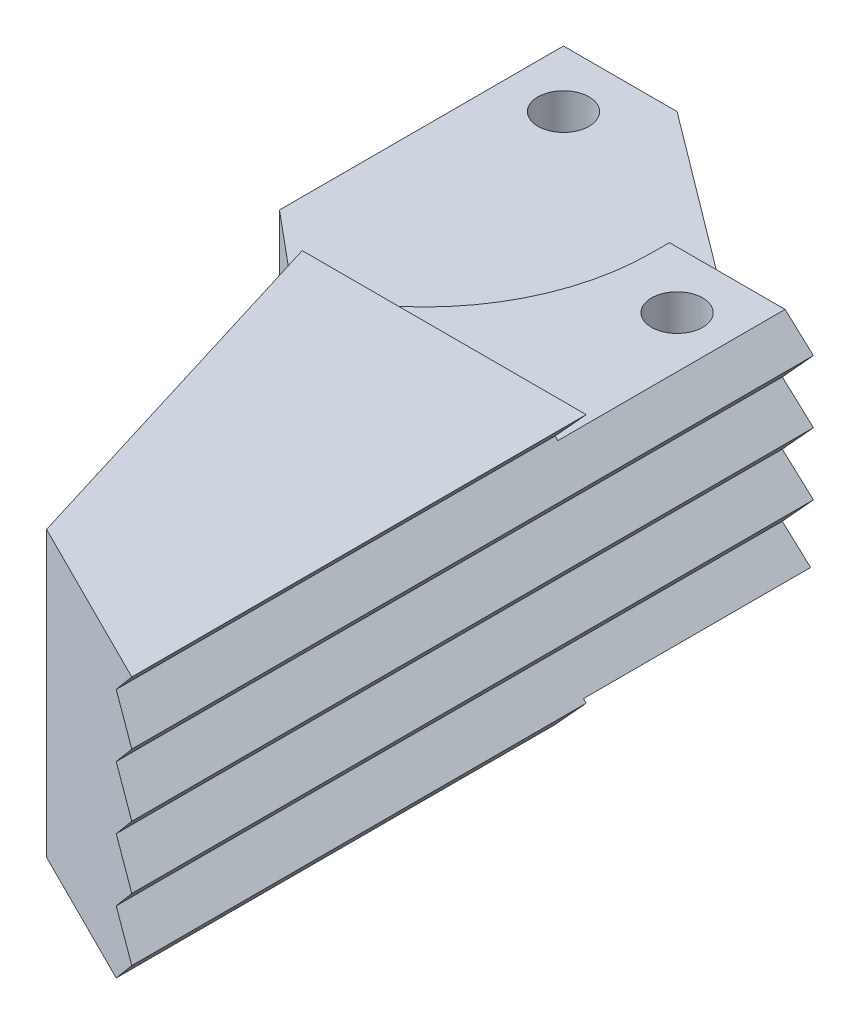
ISO-10303-21;
HEADER;
FILE_DESCRIPTION(('STEP AP214'),'2;1');
FILE_NAME('part.step','',(''),(''),'','','');
FILE_SCHEMA(('AUTOMOTIVE_DESIGN { 1 0 10303 214 1 1 1 1 }'));
ENDSEC;
DATA;
#1=APPLICATION_CONTEXT('core data for automotive mechanical design processes');
#2=APPLICATION_PROTOCOL_DEFINITION('international standard','automotive_design',2000,#1);
#3=PRODUCT_CONTEXT('',#1,'mechanical');
#4=PRODUCT('Part','Part','',(#3));
#5=PRODUCT_RELATED_PRODUCT_CATEGORY('part','',(#4));
#6=PRODUCT_DEFINITION_FORMATION('','',#4);
#7=PRODUCT_DEFINITION_CONTEXT('part definition',#1,'design');
#8=PRODUCT_DEFINITION('design','',#6,#7);
#9=PRODUCT_DEFINITION_SHAPE('','',#8);
#10=(LENGTH_UNIT() NAMED_UNIT(*) SI_UNIT(.MILLI.,.METRE.));
#11=(NAMED_UNIT(*) PLANE_ANGLE_UNIT() SI_UNIT($,.RADIAN.));
#12=(NAMED_UNIT(*) SI_UNIT($,.STERADIAN.) SOLID_ANGLE_UNIT());
#13=UNCERTAINTY_MEASURE_WITH_UNIT(LENGTH_MEASURE(1.E-05),#10,'distance_accuracy_value','');
#14=(GEOMETRIC_REPRESENTATION_CONTEXT(3) GLOBAL_UNCERTAINTY_ASSIGNED_CONTEXT((#13)) GLOBAL_UNIT_ASSIGNED_CONTEXT((#10,
#11,#12)) REPRESENTATION_CONTEXT('',''));
#15=CARTESIAN_POINT('',(0.,0.,0.));
#16=DIRECTION('',(0.,0.,1.));
#17=DIRECTION('',(1.,0.,0.));
#18=AXIS2_PLACEMENT_3D('',#15,#16,#17);
#19=CARTESIAN_POINT('',(37.,12.5,60.));
#20=DIRECTION('',(0.447213595499958,0.,-0.894427190999916));
#21=DIRECTION('',(-0.894427190999916,0.,-0.447213595499958));
#22=AXIS2_PLACEMENT_3D('',#19,#20,#21);
#23=PLANE('',#22);
#24=DIRECTION('',(-0.63887656499994,-0.699854212223765,-0.31943828249997));
#25=VECTOR('',#24,1.);
#26=CARTESIAN_POINT('',(46.8366500123377,1.27551020408162,64.9183250061688));
#27=LINE('',#26,#25);
#28=CARTESIAN_POINT('',(37.,-9.5,60.));
#29=VERTEX_POINT('',#28);
#30=CARTESIAN_POINT('',(34.2613872124742,-12.5,58.6306936062371));
#31=VERTEX_POINT('',#30);
#32=EDGE_CURVE('E217',#29,#31,#27,.T.);
#33=ORIENTED_EDGE('',*,*,#32,.F.);
#34=DIRECTION('',(0.692820323027551,-0.632455532033676,0.346410161513776));
#35=VECTOR('',#34,1.);
#36=CARTESIAN_POINT('',(27.3600829879091,-0.700000000000004,55.1800414939545));
#37=LINE('',#36,#35);
#38=CARTESIAN_POINT('',(34.2613872124742,-7.,58.6306936062371));
#39=VERTEX_POINT('',#38);
#40=EDGE_CURVE('E232',#39,#29,#37,.T.);
#41=ORIENTED_EDGE('',*,*,#40,.F.);
#42=DIRECTION('',(-0.63887656499994,-0.699854212223765,-0.31943828249997));
#43=VECTOR('',#42,1.);
#44=CARTESIAN_POINT('',(44.3774875092533,4.08163265306123,63.6887437546266));
#45=LINE('',#44,#43);
#46=CARTESIAN_POINT('',(37.,-4.,60.));
#47=VERTEX_POINT('',#46);
#48=EDGE_CURVE('E243',#47,#39,#45,.T.);
#49=ORIENTED_EDGE('',*,*,#48,.F.);
#50=DIRECTION('',(0.692820323027551,-0.632455532033675,0.346410161513776));
#51=VECTOR('',#50,1.);
#52=CARTESIAN_POINT('',(29.7700622409318,2.6,56.3850311204659));
#53=LINE('',#52,#51);
#54=CARTESIAN_POINT('',(34.2613872124742,-1.5,58.6306936062371));
#55=VERTEX_POINT('',#54);
#56=EDGE_CURVE('E528',#55,#47,#53,.T.);
#57=ORIENTED_EDGE('',*,*,#56,.F.);
#58=DIRECTION('',(-0.63887656499994,-0.699854212223765,-0.31943828249997));
#59=VECTOR('',#58,1.);
#60=CARTESIAN_POINT('',(41.9183250061688,6.88775510204082,62.4591625030844));
#61=LINE('',#60,#59);
#62=CARTESIAN_POINT('',(37.,1.5,60.));
#63=VERTEX_POINT('',#62);
#64=EDGE_CURVE('E531',#63,#55,#61,.T.);
#65=ORIENTED_EDGE('',*,*,#64,.F.);
#66=DIRECTION('',(0.692820323027551,-0.632455532033675,0.346410161513776));
#67=VECTOR('',#66,1.);
#68=CARTESIAN_POINT('',(32.1800414939545,5.9,57.5900207469773));
#69=LINE('',#68,#67);
#70=CARTESIAN_POINT('',(34.2613872124742,4.,58.6306936062371));
#71=VERTEX_POINT('',#70);
#72=EDGE_CURVE('E259',#71,#63,#69,.T.);
#73=ORIENTED_EDGE('',*,*,#72,.F.);
#74=DIRECTION('',(-0.638876564999939,-0.699854212223766,-0.31943828249997));
#75=VECTOR('',#74,1.);
#76=CARTESIAN_POINT('',(39.4591625030844,9.69387755102042,61.2295812515422));
#77=LINE('',#76,#75);
#78=CARTESIAN_POINT('',(37.,7.00000000000001,60.));
#79=VERTEX_POINT('',#78);
#80=EDGE_CURVE('E250',#79,#71,#77,.T.);
#81=ORIENTED_EDGE('',*,*,#80,.F.);
#82=DIRECTION('',(0.692820323027551,-0.632455532033676,0.346410161513776));
#83=VECTOR('',#82,1.);
#84=CARTESIAN_POINT('',(34.5900207469773,9.20000000000001,58.7950103734886));
#85=LINE('',#84,#83);
#86=CARTESIAN_POINT('',(34.2613872124742,9.50000000000001,58.6306936062371));
#87=VERTEX_POINT('',#86);
#88=EDGE_CURVE('E605',#87,#79,#85,.T.);
#89=ORIENTED_EDGE('',*,*,#88,.F.);
#90=DIRECTION('',(-0.638876564999941,-0.699854212223764,-0.319438282499971));
#91=VECTOR('',#90,1.);
#92=CARTESIAN_POINT('',(37.,12.5,60.));
#93=LINE('',#92,#91);
#94=CARTESIAN_POINT('',(37.,12.5,60.));
#95=VERTEX_POINT('',#94);
#96=EDGE_CURVE('E530',#95,#87,#93,.T.);
#97=ORIENTED_EDGE('',*,*,#96,.F.);
#98=DIRECTION('',(0.894427190999916,0.,0.447213595499958));
#99=VECTOR('',#98,1.);
#100=CARTESIAN_POINT('',(37.,12.5,60.));
#101=LINE('',#100,#99);
#102=CARTESIAN_POINT('',(22.,12.5,52.5));
#103=VERTEX_POINT('',#102);
#104=EDGE_CURVE('E368',#103,#95,#101,.T.);
#105=ORIENTED_EDGE('',*,*,#104,.F.);
#106=DIRECTION('',(0.,-1.,0.));
#107=VECTOR('',#106,1.);
#108=CARTESIAN_POINT('',(22.,12.5,52.5));
#109=LINE('',#108,#107);
#110=CARTESIAN_POINT('',(22.,-12.5,52.5));
#111=VERTEX_POINT('',#110);
#112=EDGE_CURVE('E376',#103,#111,#109,.T.);
#113=ORIENTED_EDGE('',*,*,#112,.T.);
#114=DIRECTION('',(0.894427190999916,0.,0.447213595499958));
#115=VECTOR('',#114,1.);
#116=CARTESIAN_POINT('',(37.,-12.5,60.));
#117=LINE('',#116,#115);
#118=EDGE_CURVE('E235',#111,#31,#117,.T.);
#119=ORIENTED_EDGE('',*,*,#118,.T.);
#120=EDGE_LOOP('',(#33,#41,#49,#57,#65,#73,#81,#89,#97,#105,#113,#119));
#121=FACE_BOUND('',#120,.T.);
#122=ADVANCED_FACE('F52',(#121),#23,.F.);
#123=CARTESIAN_POINT('',(37.,-4.6,20.));
#124=DIRECTION('',(0.,0.,1.));
#125=DIRECTION('',(1.,0.,0.));
#126=AXIS2_PLACEMENT_3D('',#123,#124,#125);
#127=PLANE('',#126);
#128=DIRECTION('',(0.,-1.,0.));
#129=VECTOR('',#128,1.);
#130=CARTESIAN_POINT('',(12.,12.5,20.));
#131=LINE('',#130,#129);
#132=CARTESIAN_POINT('',(12.,-9.275,20.));
#133=VERTEX_POINT('',#132);
#134=CARTESIAN_POINT('',(12.,-12.5,20.));
#135=VERTEX_POINT('',#134);
#136=EDGE_CURVE('E347',#133,#135,#131,.T.);
#137=ORIENTED_EDGE('',*,*,#136,.F.);
#138=DIRECTION('',(1.,0.,0.));
#139=VECTOR('',#138,1.);
#140=CARTESIAN_POINT('',(24.325,-9.275,20.));
#141=LINE('',#140,#139);
#142=CARTESIAN_POINT('',(36.7535248491227,-9.275,20.));
#143=VERTEX_POINT('',#142);
#144=EDGE_CURVE('E321',#133,#143,#141,.T.);
#145=ORIENTED_EDGE('',*,*,#144,.T.);
#146=DIRECTION('',(-0.738548945875997,0.674199862463242,0.));
#147=VECTOR('',#146,1.);
#148=CARTESIAN_POINT('',(34.5601449711134,-7.27272727272727,20.));
#149=LINE('',#148,#147);
#150=CARTESIAN_POINT('',(37.,-9.5,20.));
#151=VERTEX_POINT('',#150);
#152=EDGE_CURVE('E244',#151,#143,#149,.T.);
#153=ORIENTED_EDGE('',*,*,#152,.F.);
#154=DIRECTION('',(0.674199862463242,0.738548945875996,0.));
#155=VECTOR('',#154,1.);
#156=CARTESIAN_POINT('',(39.4398550288867,-6.82727272727273,20.));
#157=LINE('',#156,#155);
#158=CARTESIAN_POINT('',(34.2613872124742,-12.5,20.));
#159=VERTEX_POINT('',#158);
#160=EDGE_CURVE('E220',#159,#151,#157,.T.);
#161=ORIENTED_EDGE('',*,*,#160,.F.);
#162=DIRECTION('',(-1.,0.,0.));
#163=VECTOR('',#162,1.);
#164=CARTESIAN_POINT('',(37.,-12.5,20.));
#165=LINE('',#164,#163);
#166=EDGE_CURVE('E343',#159,#135,#165,.T.);
#167=ORIENTED_EDGE('',*,*,#166,.T.);
#168=EDGE_LOOP('',(#137,#145,#153,#161,#167));
#169=FACE_BOUND('',#168,.T.);
#170=ADVANCED_FACE('F632',(#169),#127,.F.);
#171=CARTESIAN_POINT('',(0.,-12.5,0.));
#172=DIRECTION('',(0.,-1.,0.));
#173=DIRECTION('',(0.,0.,-1.));
#174=AXIS2_PLACEMENT_3D('',#171,#172,#173);
#175=PLANE('',#174);
#176=ORIENTED_EDGE('',*,*,#166,.F.);
#177=DIRECTION('',(0.,0.,-1.));
#178=VECTOR('',#177,1.);
#179=CARTESIAN_POINT('',(34.2613872124742,-12.5,60.));
#180=LINE('',#179,#178);
#181=EDGE_CURVE('E521',#31,#159,#180,.T.);
#182=ORIENTED_EDGE('',*,*,#181,.F.);
#183=ORIENTED_EDGE('',*,*,#118,.F.);
#184=DIRECTION('',(0.294085848837523,0.,0.95577900872195));
#185=VECTOR('',#184,1.);
#186=CARTESIAN_POINT('',(22.,-12.5,52.5));
#187=LINE('',#186,#185);
#188=EDGE_CURVE('E364',#135,#111,#187,.T.);
#189=ORIENTED_EDGE('',*,*,#188,.F.);
#190=EDGE_LOOP('',(#176,#182,#183,#189));
#191=FACE_BOUND('',#190,.T.);
#192=ADVANCED_FACE('F636',(#191),#175,.T.);
#193=CARTESIAN_POINT('',(0.,12.5,0.));
#194=DIRECTION('',(0.,0.,1.));
#195=DIRECTION('',(1.,0.,0.));
#196=AXIS2_PLACEMENT_3D('',#193,#194,#195);
#197=PLANE('',#196);
#198=DIRECTION('',(0.738548945875997,-0.674199862463242,0.));
#199=VECTOR('',#198,1.);
#200=CARTESIAN_POINT('',(14.8264634272539,16.2415769342647,0.));
#201=LINE('',#200,#199);
#202=CARTESIAN_POINT('',(34.2613872124742,-1.5,0.));
#203=VERTEX_POINT('',#202);
#204=CARTESIAN_POINT('',(37.,-4.,0.));
#205=VERTEX_POINT('',#204);
#206=EDGE_CURVE('E538',#203,#205,#201,.T.);
#207=ORIENTED_EDGE('',*,*,#206,.T.);
#208=DIRECTION('',(-0.674199862463242,-0.738548945875997,0.));
#209=VECTOR('',#208,1.);
#210=CARTESIAN_POINT('',(22.1735365727461,-20.2415769342647,0.));
#211=LINE('',#210,#209);
#212=CARTESIAN_POINT('',(34.2613872124742,-7.,0.));
#213=VERTEX_POINT('',#212);
#214=EDGE_CURVE('E553',#205,#213,#211,.T.);
#215=ORIENTED_EDGE('',*,*,#214,.T.);
#216=DIRECTION('',(0.738548945875997,-0.674199862463242,0.));
#217=VECTOR('',#216,1.);
#218=CARTESIAN_POINT('',(12.0878506397281,13.2415769342647,0.));
#219=LINE('',#218,#217);
#220=CARTESIAN_POINT('',(36.7535248491227,-9.275,0.));
#221=VERTEX_POINT('',#220);
#222=EDGE_CURVE('E560',#213,#221,#219,.T.);
#223=ORIENTED_EDGE('',*,*,#222,.T.);
#224=DIRECTION('',(1.,0.,0.));
#225=VECTOR('',#224,1.);
#226=CARTESIAN_POINT('',(24.325,-9.275,0.));
#227=LINE('',#226,#225);
#228=CARTESIAN_POINT('',(24.325,-9.275,0.));
#229=VERTEX_POINT('',#228);
#230=EDGE_CURVE('E331',#229,#221,#227,.T.);
#231=ORIENTED_EDGE('',*,*,#230,.F.);
#232=DIRECTION('',(0.,1.,0.));
#233=VECTOR('',#232,1.);
#234=CARTESIAN_POINT('',(24.325,-9.275,0.));
#235=LINE('',#234,#233);
#236=CARTESIAN_POINT('',(24.325,-4.6,0.));
#237=VERTEX_POINT('',#236);
#238=EDGE_CURVE('E314',#229,#237,#235,.T.);
#239=ORIENTED_EDGE('',*,*,#238,.T.);
#240=DIRECTION('',(1.,0.,0.));
#241=VECTOR('',#240,1.);
#242=CARTESIAN_POINT('',(0.,-4.6,0.));
#243=LINE('',#242,#241);
#244=CARTESIAN_POINT('',(30.,-4.6,0.));
#245=VERTEX_POINT('',#244);
#246=EDGE_CURVE('E288',#237,#245,#243,.T.);
#247=ORIENTED_EDGE('',*,*,#246,.T.);
#248=DIRECTION('',(0.,1.,0.));
#249=VECTOR('',#248,1.);
#250=CARTESIAN_POINT('',(30.,-38.1410196624968,0.));
#251=LINE('',#250,#249);
#252=CARTESIAN_POINT('',(30.,4.6,0.));
#253=VERTEX_POINT('',#252);
#254=EDGE_CURVE('E305',#245,#253,#251,.T.);
#255=ORIENTED_EDGE('',*,*,#254,.T.);
#256=DIRECTION('',(1.,0.,0.));
#257=VECTOR('',#256,1.);
#258=CARTESIAN_POINT('',(0.,4.6,0.));
#259=LINE('',#258,#257);
#260=CARTESIAN_POINT('',(24.325,4.6,0.));
#261=VERTEX_POINT('',#260);
#262=EDGE_CURVE('E284',#261,#253,#259,.T.);
#263=ORIENTED_EDGE('',*,*,#262,.F.);
#264=CARTESIAN_POINT('',(24.325,9.275,0.));
#265=VERTEX_POINT('',#264);
#266=EDGE_CURVE('E313',#261,#265,#235,.T.);
#267=ORIENTED_EDGE('',*,*,#266,.T.);
#268=DIRECTION('',(1.,0.,0.));
#269=VECTOR('',#268,1.);
#270=CARTESIAN_POINT('',(24.325,9.275,0.));
#271=LINE('',#270,#269);
#272=CARTESIAN_POINT('',(34.5078623633515,9.275,0.));
#273=VERTEX_POINT('',#272);
#274=EDGE_CURVE('E327',#265,#273,#271,.T.);
#275=ORIENTED_EDGE('',*,*,#274,.T.);
#276=DIRECTION('',(0.738548945875996,-0.674199862463242,0.));
#277=VECTOR('',#276,1.);
#278=CARTESIAN_POINT('',(20.3036890023056,22.2415769342647,0.));
#279=LINE('',#278,#277);
#280=CARTESIAN_POINT('',(37.,7.00000000000001,0.));
#281=VERTEX_POINT('',#280);
#282=EDGE_CURVE('E237',#273,#281,#279,.T.);
#283=ORIENTED_EDGE('',*,*,#282,.T.);
#284=DIRECTION('',(-0.674199862463241,-0.738548945875997,0.));
#285=VECTOR('',#284,1.);
#286=CARTESIAN_POINT('',(16.6963109976945,-15.2415769342647,0.));
#287=LINE('',#286,#285);
#288=CARTESIAN_POINT('',(34.2613872124742,4.,0.));
#289=VERTEX_POINT('',#288);
#290=EDGE_CURVE('E574',#281,#289,#287,.T.);
#291=ORIENTED_EDGE('',*,*,#290,.T.);
#292=DIRECTION('',(0.738548945875997,-0.674199862463242,0.));
#293=VECTOR('',#292,1.);
#294=CARTESIAN_POINT('',(17.5650762147798,19.2415769342647,0.));
#295=LINE('',#294,#293);
#296=CARTESIAN_POINT('',(37.,1.5,0.));
#297=VERTEX_POINT('',#296);
#298=EDGE_CURVE('E225',#289,#297,#295,.T.);
#299=ORIENTED_EDGE('',*,*,#298,.T.);
#300=DIRECTION('',(-0.674199862463242,-0.738548945875997,0.));
#301=VECTOR('',#300,1.);
#302=CARTESIAN_POINT('',(19.4349237852202,-17.7415769342647,0.));
#303=LINE('',#302,#301);
#304=EDGE_CURVE('E550',#297,#203,#303,.T.);
#305=ORIENTED_EDGE('',*,*,#304,.T.);
#306=EDGE_LOOP('',(#207,#215,#223,#231,#239,#247,#255,#263,#267,#275,#283,#291,#299,#305));
#307=FACE_BOUND('',#306,.T.);
#308=ADVANCED_FACE('F593',(#307),#197,.F.);
#309=CARTESIAN_POINT('',(37.,4.6,20.));
#310=DIRECTION('',(0.,0.,1.));
#311=DIRECTION('',(1.,0.,0.));
#312=AXIS2_PLACEMENT_3D('',#309,#310,#311);
#313=PLANE('',#312);
#314=DIRECTION('',(1.,0.,0.));
#315=VECTOR('',#314,1.);
#316=CARTESIAN_POINT('',(24.325,9.275,20.));
#317=LINE('',#316,#315);
#318=CARTESIAN_POINT('',(12.,9.275,20.));
#319=VERTEX_POINT('',#318);
#320=CARTESIAN_POINT('',(34.5078623633515,9.275,20.));
#321=VERTEX_POINT('',#320);
#322=EDGE_CURVE('E322',#319,#321,#317,.T.);
#323=ORIENTED_EDGE('',*,*,#322,.F.);
#324=DIRECTION('',(0.,-1.,0.));
#325=VECTOR('',#324,1.);
#326=CARTESIAN_POINT('',(12.,12.5,20.));
#327=LINE('',#326,#325);
#328=CARTESIAN_POINT('',(12.,12.5,20.));
#329=VERTEX_POINT('',#328);
#330=EDGE_CURVE('E384',#329,#319,#327,.T.);
#331=ORIENTED_EDGE('',*,*,#330,.F.);
#332=DIRECTION('',(-1.,0.,0.));
#333=VECTOR('',#332,1.);
#334=CARTESIAN_POINT('',(0.,12.5,20.));
#335=LINE('',#334,#333);
#336=CARTESIAN_POINT('',(37.,12.5,20.));
#337=VERTEX_POINT('',#336);
#338=EDGE_CURVE('E289',#337,#329,#335,.T.);
#339=ORIENTED_EDGE('',*,*,#338,.F.);
#340=DIRECTION('',(0.674199862463243,0.738548945875996,0.));
#341=VECTOR('',#340,1.);
#342=CARTESIAN_POINT('',(33.0663561779174,8.1909090909091,20.));
#343=LINE('',#342,#341);
#344=CARTESIAN_POINT('',(34.2613872124742,9.50000000000001,20.));
#345=VERTEX_POINT('',#344);
#346=EDGE_CURVE('E402',#345,#337,#343,.T.);
#347=ORIENTED_EDGE('',*,*,#346,.F.);
#348=DIRECTION('',(-0.738548945875996,0.674199862463242,0.));
#349=VECTOR('',#348,1.);
#350=CARTESIAN_POINT('',(38.1950310345567,5.90909090909091,20.));
#351=LINE('',#350,#349);
#352=EDGE_CURVE('E602',#321,#345,#351,.T.);
#353=ORIENTED_EDGE('',*,*,#352,.F.);
#354=EDGE_LOOP('',(#323,#331,#339,#347,#353));
#355=FACE_BOUND('',#354,.T.);
#356=ADVANCED_FACE('F676',(#355),#313,.F.);
#357=CARTESIAN_POINT('',(24.325,9.275,20.));
#358=DIRECTION('',(0.,1.,0.));
#359=DIRECTION('',(0.,0.,1.));
#360=AXIS2_PLACEMENT_3D('',#357,#358,#359);
#361=PLANE('',#360);
#362=CARTESIAN_POINT('',(30.,9.275,5.));
#363=DIRECTION('',(0.,1.,0.));
#364=DIRECTION('',(0.,0.,1.));
#365=AXIS2_PLACEMENT_3D('',#362,#363,#364);
#366=CIRCLE('',#365,2.24999999999999);
#367=CARTESIAN_POINT('',(30.,9.275,7.24999999999999));
#368=VERTEX_POINT('',#367);
#369=EDGE_CURVE('E263',#368,#368,#366,.T.);
#370=ORIENTED_EDGE('',*,*,#369,.F.);
#371=EDGE_LOOP('',(#370));
#372=FACE_BOUND('',#371,.T.);
#373=ORIENTED_EDGE('',*,*,#322,.T.);
#374=DIRECTION('',(0.,0.,-1.));
#375=VECTOR('',#374,1.);
#376=CARTESIAN_POINT('',(34.5078623633515,9.275,20.));
#377=LINE('',#376,#375);
#378=EDGE_CURVE('E455',#321,#273,#377,.T.);
#379=ORIENTED_EDGE('',*,*,#378,.T.);
#380=ORIENTED_EDGE('',*,*,#274,.F.);
#381=DIRECTION('',(0.,0.,1.));
#382=VECTOR('',#381,1.);
#383=CARTESIAN_POINT('',(24.325,9.275,20.));
#384=LINE('',#383,#382);
#385=CARTESIAN_POINT('',(24.325,9.275,1.53125951776895));
#386=VERTEX_POINT('',#385);
#387=EDGE_CURVE('E318',#265,#386,#384,.T.);
#388=ORIENTED_EDGE('',*,*,#387,.T.);
#389=CARTESIAN_POINT('',(4.32500000000001,9.275,1.53125951776895));
#390=DIRECTION('',(0.,1.,0.));
#391=DIRECTION('',(0.,0.,1.));
#392=AXIS2_PLACEMENT_3D('',#389,#390,#391);
#393=CIRCLE('',#392,20.);
#394=EDGE_CURVE('E12',#386,#319,#393,.F.);
#395=ORIENTED_EDGE('',*,*,#394,.T.);
#396=EDGE_LOOP('',(#373,#379,#380,#388,#395));
#397=FACE_BOUND('',#396,.T.);
#398=ADVANCED_FACE('F600',(#372,#397),#361,.T.);
#399=CARTESIAN_POINT('',(24.325,-9.275,20.));
#400=DIRECTION('',(0.,-1.,0.));
#401=DIRECTION('',(0.,0.,-1.));
#402=AXIS2_PLACEMENT_3D('',#399,#400,#401);
#403=PLANE('',#402);
#404=CARTESIAN_POINT('',(30.,-9.275,5.));
#405=DIRECTION('',(0.,-1.,0.));
#406=DIRECTION('',(0.,0.,-1.));
#407=AXIS2_PLACEMENT_3D('',#404,#405,#406);
#408=CIRCLE('',#407,2.24999999999999);
#409=CARTESIAN_POINT('',(30.,-9.275,2.75000000000001));
#410=VERTEX_POINT('',#409);
#411=EDGE_CURVE('E267',#410,#410,#408,.T.);
#412=ORIENTED_EDGE('',*,*,#411,.F.);
#413=EDGE_LOOP('',(#412));
#414=FACE_BOUND('',#413,.T.);
#415=ORIENTED_EDGE('',*,*,#230,.T.);
#416=DIRECTION('',(0.,0.,1.));
#417=VECTOR('',#416,1.);
#418=CARTESIAN_POINT('',(36.7535248491227,-9.275,20.));
#419=LINE('',#418,#417);
#420=EDGE_CURVE('E296',#221,#143,#419,.T.);
#421=ORIENTED_EDGE('',*,*,#420,.T.);
#422=ORIENTED_EDGE('',*,*,#144,.F.);
#423=CARTESIAN_POINT('',(4.32500000000001,-9.275,1.53125951776895));
#424=DIRECTION('',(0.,-1.,0.));
#425=DIRECTION('',(0.,0.,-1.));
#426=AXIS2_PLACEMENT_3D('',#423,#424,#425);
#427=CIRCLE('',#426,20.);
#428=CARTESIAN_POINT('',(24.325,-9.275,1.53125951776895));
#429=VERTEX_POINT('',#428);
#430=EDGE_CURVE('E61',#133,#429,#427,.F.);
#431=ORIENTED_EDGE('',*,*,#430,.T.);
#432=DIRECTION('',(0.,0.,-1.));
#433=VECTOR('',#432,1.);
#434=CARTESIAN_POINT('',(24.325,-9.275,20.));
#435=LINE('',#434,#433);
#436=EDGE_CURVE('E310',#429,#229,#435,.T.);
#437=ORIENTED_EDGE('',*,*,#436,.T.);
#438=EDGE_LOOP('',(#415,#421,#422,#431,#437));
#439=FACE_BOUND('',#438,.T.);
#440=ADVANCED_FACE('F420',(#414,#439),#403,.T.);
#441=CARTESIAN_POINT('',(0.,12.5,10.));
#442=DIRECTION('',(1.,0.,0.));
#443=DIRECTION('',(0.,0.,-1.));
#444=AXIS2_PLACEMENT_3D('',#441,#442,#443);
#445=PLANE('',#444);
#446=DIRECTION('',(0.,0.,-1.));
#447=VECTOR('',#446,1.);
#448=CARTESIAN_POINT('',(0.,-4.6,0.));
#449=LINE('',#448,#447);
#450=CARTESIAN_POINT('',(0.,-4.6,9.99999999999999));
#451=VERTEX_POINT('',#450);
#452=CARTESIAN_POINT('',(0.,-4.6,-15.));
#453=VERTEX_POINT('',#452);
#454=EDGE_CURVE('E344',#451,#453,#449,.T.);
#455=ORIENTED_EDGE('',*,*,#454,.F.);
#456=DIRECTION('',(0.,-1.,0.));
#457=VECTOR('',#456,1.);
#458=CARTESIAN_POINT('',(0.,12.5,10.));
#459=LINE('',#458,#457);
#460=CARTESIAN_POINT('',(0.,4.6,9.99999999999999));
#461=VERTEX_POINT('',#460);
#462=EDGE_CURVE('E388',#461,#451,#459,.T.);
#463=ORIENTED_EDGE('',*,*,#462,.F.);
#464=DIRECTION('',(0.,0.,1.));
#465=VECTOR('',#464,1.);
#466=CARTESIAN_POINT('',(0.,4.6,0.));
#467=LINE('',#466,#465);
#468=CARTESIAN_POINT('',(0.,4.6,-15.));
#469=VERTEX_POINT('',#468);
#470=EDGE_CURVE('E357',#469,#461,#467,.T.);
#471=ORIENTED_EDGE('',*,*,#470,.F.);
#472=DIRECTION('',(0.,1.,0.));
#473=VECTOR('',#472,1.);
#474=CARTESIAN_POINT('',(0.,-38.1410196624968,-15.));
#475=LINE('',#474,#473);
#476=EDGE_CURVE('E301',#453,#469,#475,.T.);
#477=ORIENTED_EDGE('',*,*,#476,.F.);
#478=EDGE_LOOP('',(#455,#463,#471,#477));
#479=FACE_BOUND('',#478,.T.);
#480=ADVANCED_FACE('F647',(#479),#445,.F.);
#481=CARTESIAN_POINT('',(12.,12.5,20.));
#482=DIRECTION('',(0.64018439966448,0.,-0.768221279597376));
#483=DIRECTION('',(-0.768221279597376,0.,-0.64018439966448));
#484=AXIS2_PLACEMENT_3D('',#481,#482,#483);
#485=PLANE('',#484);
#486=DIRECTION('',(-0.768221279597376,0.,-0.64018439966448));
#487=VECTOR('',#486,1.);
#488=CARTESIAN_POINT('',(12.,-4.6,20.));
#489=LINE('',#488,#487);
#490=CARTESIAN_POINT('',(12.,-4.6,20.));
#491=VERTEX_POINT('',#490);
#492=EDGE_CURVE('E354',#491,#451,#489,.T.);
#493=ORIENTED_EDGE('',*,*,#492,.F.);
#494=CARTESIAN_POINT('',(12.,4.6,20.));
#495=VERTEX_POINT('',#494);
#496=EDGE_CURVE('E383',#495,#491,#327,.T.);
#497=ORIENTED_EDGE('',*,*,#496,.F.);
#498=DIRECTION('',(-0.768221279597376,0.,-0.64018439966448));
#499=VECTOR('',#498,1.);
#500=CARTESIAN_POINT('',(12.,4.6,20.));
#501=LINE('',#500,#499);
#502=EDGE_CURVE('E360',#495,#461,#501,.T.);
#503=ORIENTED_EDGE('',*,*,#502,.T.);
#504=ORIENTED_EDGE('',*,*,#462,.T.);
#505=EDGE_LOOP('',(#493,#497,#503,#504));
#506=FACE_BOUND('',#505,.T.);
#507=ADVANCED_FACE('F440',(#506),#485,.F.);
#508=CARTESIAN_POINT('',(22.,12.5,52.5));
#509=DIRECTION('',(0.95577900872195,0.,-0.294085848837523));
#510=DIRECTION('',(-0.294085848837523,0.,-0.95577900872195));
#511=AXIS2_PLACEMENT_3D('',#508,#509,#510);
#512=PLANE('',#511);
#513=ORIENTED_EDGE('',*,*,#188,.T.);
#514=ORIENTED_EDGE('',*,*,#112,.F.);
#515=DIRECTION('',(0.294085848837523,0.,0.95577900872195));
#516=VECTOR('',#515,1.);
#517=CARTESIAN_POINT('',(22.,12.5,52.5));
#518=LINE('',#517,#516);
#519=EDGE_CURVE('E365',#329,#103,#518,.T.);
#520=ORIENTED_EDGE('',*,*,#519,.F.);
#521=ORIENTED_EDGE('',*,*,#330,.T.);
#522=EDGE_CURVE('E389',#319,#495,#327,.T.);
#523=ORIENTED_EDGE('',*,*,#522,.T.);
#524=ORIENTED_EDGE('',*,*,#496,.T.);
#525=EDGE_CURVE('E350',#491,#133,#131,.T.);
#526=ORIENTED_EDGE('',*,*,#525,.T.);
#527=ORIENTED_EDGE('',*,*,#136,.T.);
#528=EDGE_LOOP('',(#513,#514,#520,#521,#523,#524,#526,#527));
#529=FACE_BOUND('',#528,.T.);
#530=ADVANCED_FACE('F444',(#529),#512,.F.);
#531=CARTESIAN_POINT('',(0.,12.5,0.));
#532=DIRECTION('',(0.,-1.,0.));
#533=DIRECTION('',(0.,0.,-1.));
#534=AXIS2_PLACEMENT_3D('',#531,#532,#533);
#535=PLANE('',#534);
#536=DIRECTION('',(0.,0.,-1.));
#537=VECTOR('',#536,1.);
#538=CARTESIAN_POINT('',(37.,12.5,0.));
#539=LINE('',#538,#537);
#540=EDGE_CURVE('E372',#95,#337,#539,.T.);
#541=ORIENTED_EDGE('',*,*,#540,.T.);
#542=ORIENTED_EDGE('',*,*,#338,.T.);
#543=ORIENTED_EDGE('',*,*,#519,.T.);
#544=ORIENTED_EDGE('',*,*,#104,.T.);
#545=EDGE_LOOP('',(#541,#542,#543,#544));
#546=FACE_BOUND('',#545,.T.);
#547=ADVANCED_FACE('F644',(#546),#535,.F.);
#548=CARTESIAN_POINT('',(0.,4.6,0.));
#549=DIRECTION('',(0.,-1.,0.));
#550=DIRECTION('',(0.,0.,-1.));
#551=AXIS2_PLACEMENT_3D('',#548,#549,#550);
#552=PLANE('',#551);
#553=CARTESIAN_POINT('',(5.,4.6,-10.));
#554=DIRECTION('',(0.,-1.,0.));
#555=DIRECTION('',(0.,0.,-1.));
#556=AXIS2_PLACEMENT_3D('',#553,#554,#555);
#557=CIRCLE('',#556,2.24999999999999);
#558=CARTESIAN_POINT('',(5.,4.6,-12.25));
#559=VERTEX_POINT('',#558);
#560=EDGE_CURVE('E271',#559,#559,#557,.T.);
#561=ORIENTED_EDGE('',*,*,#560,.T.);
#562=EDGE_LOOP('',(#561));
#563=FACE_BOUND('',#562,.T.);
#564=ORIENTED_EDGE('',*,*,#502,.F.);
#565=CARTESIAN_POINT('',(4.32500000000001,4.6,1.53125951776895));
#566=DIRECTION('',(0.,-1.,0.));
#567=DIRECTION('',(0.,0.,-1.));
#568=AXIS2_PLACEMENT_3D('',#565,#566,#567);
#569=CIRCLE('',#568,20.);
#570=CARTESIAN_POINT('',(24.325,4.6,1.53125951776895));
#571=VERTEX_POINT('',#570);
#572=EDGE_CURVE('E76',#495,#571,#569,.F.);
#573=ORIENTED_EDGE('',*,*,#572,.T.);
#574=DIRECTION('',(0.,0.,-1.));
#575=VECTOR('',#574,1.);
#576=CARTESIAN_POINT('',(24.325,4.6,0.));
#577=LINE('',#576,#575);
#578=EDGE_CURVE('E340',#571,#261,#577,.T.);
#579=ORIENTED_EDGE('',*,*,#578,.T.);
#580=ORIENTED_EDGE('',*,*,#262,.T.);
#581=DIRECTION('',(-0.8,0.,-0.6));
#582=VECTOR('',#581,1.);
#583=CARTESIAN_POINT('',(30.,4.6,0.));
#584=LINE('',#583,#582);
#585=CARTESIAN_POINT('',(10.,4.6,-15.));
#586=VERTEX_POINT('',#585);
#587=EDGE_CURVE('E275',#253,#586,#584,.T.);
#588=ORIENTED_EDGE('',*,*,#587,.T.);
#589=DIRECTION('',(-1.,0.,0.));
#590=VECTOR('',#589,1.);
#591=CARTESIAN_POINT('',(10.,4.6,-15.));
#592=LINE('',#591,#590);
#593=EDGE_CURVE('E276',#586,#469,#592,.T.);
#594=ORIENTED_EDGE('',*,*,#593,.T.);
#595=ORIENTED_EDGE('',*,*,#470,.T.);
#596=EDGE_LOOP('',(#564,#573,#579,#580,#588,#594,#595));
#597=FACE_BOUND('',#596,.T.);
#598=ADVANCED_FACE('F664',(#563,#597),#552,.F.);
#599=CARTESIAN_POINT('',(0.,-4.6,0.));
#600=DIRECTION('',(0.,-1.,0.));
#601=DIRECTION('',(0.,0.,-1.));
#602=AXIS2_PLACEMENT_3D('',#599,#600,#601);
#603=PLANE('',#602);
#604=CARTESIAN_POINT('',(5.,-4.6,-10.));
#605=DIRECTION('',(0.,-1.,0.));
#606=DIRECTION('',(0.,0.,-1.));
#607=AXIS2_PLACEMENT_3D('',#604,#605,#606);
#608=CIRCLE('',#607,2.24999999999999);
#609=CARTESIAN_POINT('',(5.,-4.6,-12.25));
#610=VERTEX_POINT('',#609);
#611=EDGE_CURVE('E270',#610,#610,#608,.T.);
#612=ORIENTED_EDGE('',*,*,#611,.F.);
#613=EDGE_LOOP('',(#612));
#614=FACE_BOUND('',#613,.T.);
#615=DIRECTION('',(0.,0.,-1.));
#616=VECTOR('',#615,1.);
#617=CARTESIAN_POINT('',(24.325,-4.6,0.));
#618=LINE('',#617,#616);
#619=CARTESIAN_POINT('',(24.325,-4.6,1.53125951776895));
#620=VERTEX_POINT('',#619);
#621=EDGE_CURVE('E326',#620,#237,#618,.T.);
#622=ORIENTED_EDGE('',*,*,#621,.F.);
#623=CARTESIAN_POINT('',(4.32500000000001,-4.6,1.53125951776895));
#624=DIRECTION('',(0.,-1.,0.));
#625=DIRECTION('',(0.,0.,-1.));
#626=AXIS2_PLACEMENT_3D('',#623,#624,#625);
#627=CIRCLE('',#626,20.);
#628=EDGE_CURVE('E408',#620,#491,#627,.T.);
#629=ORIENTED_EDGE('',*,*,#628,.T.);
#630=ORIENTED_EDGE('',*,*,#492,.T.);
#631=ORIENTED_EDGE('',*,*,#454,.T.);
#632=DIRECTION('',(-1.,0.,0.));
#633=VECTOR('',#632,1.);
#634=CARTESIAN_POINT('',(10.,-4.6,-15.));
#635=LINE('',#634,#633);
#636=CARTESIAN_POINT('',(10.,-4.6,-15.));
#637=VERTEX_POINT('',#636);
#638=EDGE_CURVE('E297',#637,#453,#635,.T.);
#639=ORIENTED_EDGE('',*,*,#638,.F.);
#640=DIRECTION('',(-0.8,0.,-0.6));
#641=VECTOR('',#640,1.);
#642=CARTESIAN_POINT('',(30.,-4.6,0.));
#643=LINE('',#642,#641);
#644=EDGE_CURVE('E280',#245,#637,#643,.T.);
#645=ORIENTED_EDGE('',*,*,#644,.F.);
#646=ORIENTED_EDGE('',*,*,#246,.F.);
#647=EDGE_LOOP('',(#622,#629,#630,#631,#639,#645,#646));
#648=FACE_BOUND('',#647,.T.);
#649=ADVANCED_FACE('F434',(#614,#648),#603,.T.);
#650=CARTESIAN_POINT('',(24.325,0.,0.));
#651=DIRECTION('',(-1.,0.,0.));
#652=DIRECTION('',(0.,0.,1.));
#653=AXIS2_PLACEMENT_3D('',#650,#651,#652);
#654=PLANE('',#653);
#655=ORIENTED_EDGE('',*,*,#436,.F.);
#656=DIRECTION('',(0.,-1.,0.));
#657=VECTOR('',#656,1.);
#658=CARTESIAN_POINT('',(24.325,-4.6,1.53125951776895));
#659=LINE('',#658,#657);
#660=EDGE_CURVE('E405',#429,#620,#659,.F.);
#661=ORIENTED_EDGE('',*,*,#660,.T.);
#662=ORIENTED_EDGE('',*,*,#621,.T.);
#663=ORIENTED_EDGE('',*,*,#238,.F.);
#664=EDGE_LOOP('',(#655,#661,#662,#663));
#665=FACE_BOUND('',#664,.T.);
#666=ADVANCED_FACE('F428',(#665),#654,.T.);
#667=ORIENTED_EDGE('',*,*,#578,.F.);
#668=DIRECTION('',(0.,-1.,0.));
#669=VECTOR('',#668,1.);
#670=CARTESIAN_POINT('',(24.325,9.275,1.53125951776895));
#671=LINE('',#670,#669);
#672=EDGE_CURVE('E68',#571,#386,#671,.F.);
#673=ORIENTED_EDGE('',*,*,#672,.T.);
#674=ORIENTED_EDGE('',*,*,#387,.F.);
#675=ORIENTED_EDGE('',*,*,#266,.F.);
#676=EDGE_LOOP('',(#667,#673,#674,#675));
#677=FACE_BOUND('',#676,.T.);
#678=ADVANCED_FACE('F625',(#677),#654,.T.);
#679=CARTESIAN_POINT('',(30.,-38.1410196624968,0.));
#680=DIRECTION('',(0.6,0.,-0.8));
#681=DIRECTION('',(-0.8,0.,-0.6));
#682=AXIS2_PLACEMENT_3D('',#679,#680,#681);
#683=PLANE('',#682);
#684=ORIENTED_EDGE('',*,*,#254,.F.);
#685=ORIENTED_EDGE('',*,*,#644,.T.);
#686=DIRECTION('',(0.,1.,0.));
#687=VECTOR('',#686,1.);
#688=CARTESIAN_POINT('',(10.,-38.1410196624968,-15.));
#689=LINE('',#688,#687);
#690=EDGE_CURVE('E293',#637,#586,#689,.T.);
#691=ORIENTED_EDGE('',*,*,#690,.T.);
#692=ORIENTED_EDGE('',*,*,#587,.F.);
#693=EDGE_LOOP('',(#684,#685,#691,#692));
#694=FACE_BOUND('',#693,.T.);
#695=ADVANCED_FACE('F663',(#694),#683,.T.);
#696=CARTESIAN_POINT('',(10.,-38.1410196624968,-15.));
#697=DIRECTION('',(0.,0.,-1.));
#698=DIRECTION('',(-1.,0.,0.));
#699=AXIS2_PLACEMENT_3D('',#696,#697,#698);
#700=PLANE('',#699);
#701=ORIENTED_EDGE('',*,*,#690,.F.);
#702=ORIENTED_EDGE('',*,*,#638,.T.);
#703=ORIENTED_EDGE('',*,*,#476,.T.);
#704=ORIENTED_EDGE('',*,*,#593,.F.);
#705=EDGE_LOOP('',(#701,#702,#703,#704));
#706=FACE_BOUND('',#705,.T.);
#707=ADVANCED_FACE('F660',(#706),#700,.T.);
#708=CARTESIAN_POINT('',(5.,9.275,-10.));
#709=DIRECTION('',(0.,1.,0.));
#710=DIRECTION('',(0.,0.,1.));
#711=AXIS2_PLACEMENT_3D('',#708,#709,#710);
#712=CYLINDRICAL_SURFACE('',#711,2.24999999999999);
#713=ORIENTED_EDGE('',*,*,#611,.T.);
#714=EDGE_LOOP('',(#713));
#715=FACE_BOUND('',#714,.T.);
#716=ORIENTED_EDGE('',*,*,#560,.F.);
#717=EDGE_LOOP('',(#716));
#718=FACE_BOUND('',#717,.T.);
#719=ADVANCED_FACE('F710',(#715,#718),#712,.F.);
#720=CARTESIAN_POINT('',(30.,9.275,5.));
#721=DIRECTION('',(0.,1.,0.));
#722=DIRECTION('',(0.,0.,1.));
#723=AXIS2_PLACEMENT_3D('',#720,#721,#722);
#724=CYLINDRICAL_SURFACE('',#723,2.24999999999999);
#725=ORIENTED_EDGE('',*,*,#411,.T.);
#726=EDGE_LOOP('',(#725));
#727=FACE_BOUND('',#726,.T.);
#728=ORIENTED_EDGE('',*,*,#369,.T.);
#729=EDGE_LOOP('',(#728));
#730=FACE_BOUND('',#729,.T.);
#731=ADVANCED_FACE('F705',(#727,#730),#724,.F.);
#732=CARTESIAN_POINT('',(22.1735365727461,-20.2415769342647,60.));
#733=DIRECTION('',(0.738548945875997,-0.674199862463242,0.));
#734=DIRECTION('',(0.674199862463242,0.738548945875997,0.));
#735=AXIS2_PLACEMENT_3D('',#732,#733,#734);
#736=PLANE('',#735);
#737=ORIENTED_EDGE('',*,*,#48,.T.);
#738=DIRECTION('',(0.,0.,-1.));
#739=VECTOR('',#738,1.);
#740=CARTESIAN_POINT('',(34.2613872124742,-7.,60.));
#741=LINE('',#740,#739);
#742=EDGE_CURVE('E226',#39,#213,#741,.T.);
#743=ORIENTED_EDGE('',*,*,#742,.T.);
#744=ORIENTED_EDGE('',*,*,#214,.F.);
#745=DIRECTION('',(0.,0.,-1.));
#746=VECTOR('',#745,1.);
#747=CARTESIAN_POINT('',(37.,-4.,60.));
#748=LINE('',#747,#746);
#749=EDGE_CURVE('E453',#47,#205,#748,.T.);
#750=ORIENTED_EDGE('',*,*,#749,.F.);
#751=EDGE_LOOP('',(#737,#743,#744,#750));
#752=FACE_BOUND('',#751,.T.);
#753=ADVANCED_FACE('F618',(#752),#736,.T.);
#754=CARTESIAN_POINT('',(12.0878506397281,13.2415769342647,60.));
#755=DIRECTION('',(0.674199862463242,0.738548945875997,0.));
#756=DIRECTION('',(-0.738548945875997,0.674199862463242,0.));
#757=AXIS2_PLACEMENT_3D('',#754,#755,#756);
#758=PLANE('',#757);
#759=ORIENTED_EDGE('',*,*,#40,.T.);
#760=DIRECTION('',(0.,0.,-1.));
#761=VECTOR('',#760,1.);
#762=CARTESIAN_POINT('',(37.,-9.5,60.));
#763=LINE('',#762,#761);
#764=EDGE_CURVE('E214',#29,#151,#763,.T.);
#765=ORIENTED_EDGE('',*,*,#764,.T.);
#766=ORIENTED_EDGE('',*,*,#152,.T.);
#767=ORIENTED_EDGE('',*,*,#420,.F.);
#768=ORIENTED_EDGE('',*,*,#222,.F.);
#769=ORIENTED_EDGE('',*,*,#742,.F.);
#770=EDGE_LOOP('',(#759,#765,#766,#767,#768,#769));
#771=FACE_BOUND('',#770,.T.);
#772=ADVANCED_FACE('F240',(#771),#758,.T.);
#773=CARTESIAN_POINT('',(17.5650762147798,19.2415769342647,60.));
#774=DIRECTION('',(0.674199862463242,0.738548945875997,0.));
#775=DIRECTION('',(-0.738548945875997,0.674199862463242,0.));
#776=AXIS2_PLACEMENT_3D('',#773,#774,#775);
#777=PLANE('',#776);
#778=ORIENTED_EDGE('',*,*,#72,.T.);
#779=DIRECTION('',(0.,0.,-1.));
#780=VECTOR('',#779,1.);
#781=CARTESIAN_POINT('',(37.,1.5,60.));
#782=LINE('',#781,#780);
#783=EDGE_CURVE('E253',#63,#297,#782,.T.);
#784=ORIENTED_EDGE('',*,*,#783,.T.);
#785=ORIENTED_EDGE('',*,*,#298,.F.);
#786=DIRECTION('',(0.,0.,-1.));
#787=VECTOR('',#786,1.);
#788=CARTESIAN_POINT('',(34.2613872124742,4.,60.));
#789=LINE('',#788,#787);
#790=EDGE_CURVE('E469',#71,#289,#789,.T.);
#791=ORIENTED_EDGE('',*,*,#790,.F.);
#792=EDGE_LOOP('',(#778,#784,#785,#791));
#793=FACE_BOUND('',#792,.T.);
#794=ADVANCED_FACE('F589',(#793),#777,.T.);
#795=CARTESIAN_POINT('',(16.6963109976945,-15.2415769342647,60.));
#796=DIRECTION('',(0.738548945875998,-0.674199862463241,0.));
#797=DIRECTION('',(0.674199862463241,0.738548945875998,0.));
#798=AXIS2_PLACEMENT_3D('',#795,#796,#797);
#799=PLANE('',#798);
#800=ORIENTED_EDGE('',*,*,#80,.T.);
#801=ORIENTED_EDGE('',*,*,#790,.T.);
#802=ORIENTED_EDGE('',*,*,#290,.F.);
#803=DIRECTION('',(0.,0.,-1.));
#804=VECTOR('',#803,1.);
#805=CARTESIAN_POINT('',(37.,7.00000000000001,60.));
#806=LINE('',#805,#804);
#807=EDGE_CURVE('E467',#79,#281,#806,.T.);
#808=ORIENTED_EDGE('',*,*,#807,.F.);
#809=EDGE_LOOP('',(#800,#801,#802,#808));
#810=FACE_BOUND('',#809,.T.);
#811=ADVANCED_FACE('F584',(#810),#799,.T.);
#812=CARTESIAN_POINT('',(13.9576982101685,-12.7415769342647,60.));
#813=DIRECTION('',(0.738548945875996,-0.674199862463243,0.));
#814=DIRECTION('',(0.674199862463243,0.738548945875996,0.));
#815=AXIS2_PLACEMENT_3D('',#812,#813,#814);
#816=PLANE('',#815);
#817=ORIENTED_EDGE('',*,*,#96,.T.);
#818=DIRECTION('',(0.,0.,-1.));
#819=VECTOR('',#818,1.);
#820=CARTESIAN_POINT('',(34.2613872124742,9.50000000000001,60.));
#821=LINE('',#820,#819);
#822=EDGE_CURVE('E535',#87,#345,#821,.T.);
#823=ORIENTED_EDGE('',*,*,#822,.T.);
#824=ORIENTED_EDGE('',*,*,#346,.T.);
#825=ORIENTED_EDGE('',*,*,#540,.F.);
#826=EDGE_LOOP('',(#817,#823,#824,#825));
#827=FACE_BOUND('',#826,.T.);
#828=ADVANCED_FACE('F691',(#827),#816,.T.);
#829=CARTESIAN_POINT('',(20.3036890023056,22.2415769342647,60.));
#830=DIRECTION('',(0.674199862463242,0.738548945875996,0.));
#831=DIRECTION('',(-0.738548945875996,0.674199862463242,0.));
#832=AXIS2_PLACEMENT_3D('',#829,#830,#831);
#833=PLANE('',#832);
#834=ORIENTED_EDGE('',*,*,#88,.T.);
#835=ORIENTED_EDGE('',*,*,#807,.T.);
#836=ORIENTED_EDGE('',*,*,#282,.F.);
#837=ORIENTED_EDGE('',*,*,#378,.F.);
#838=ORIENTED_EDGE('',*,*,#352,.T.);
#839=ORIENTED_EDGE('',*,*,#822,.F.);
#840=EDGE_LOOP('',(#834,#835,#836,#837,#838,#839));
#841=FACE_BOUND('',#840,.T.);
#842=ADVANCED_FACE('F597',(#841),#833,.T.);
#843=CARTESIAN_POINT('',(14.8264634272539,16.2415769342647,60.));
#844=DIRECTION('',(0.674199862463242,0.738548945875997,0.));
#845=DIRECTION('',(-0.738548945875997,0.674199862463242,0.));
#846=AXIS2_PLACEMENT_3D('',#843,#844,#845);
#847=PLANE('',#846);
#848=ORIENTED_EDGE('',*,*,#56,.T.);
#849=ORIENTED_EDGE('',*,*,#749,.T.);
#850=ORIENTED_EDGE('',*,*,#206,.F.);
#851=DIRECTION('',(0.,0.,-1.));
#852=VECTOR('',#851,1.);
#853=CARTESIAN_POINT('',(34.2613872124742,-1.5,60.));
#854=LINE('',#853,#852);
#855=EDGE_CURVE('E456',#55,#203,#854,.T.);
#856=ORIENTED_EDGE('',*,*,#855,.F.);
#857=EDGE_LOOP('',(#848,#849,#850,#856));
#858=FACE_BOUND('',#857,.T.);
#859=ADVANCED_FACE('F615',(#858),#847,.T.);
#860=CARTESIAN_POINT('',(19.4349237852202,-17.7415769342647,60.));
#861=DIRECTION('',(0.738548945875997,-0.674199862463242,0.));
#862=DIRECTION('',(0.674199862463242,0.738548945875997,0.));
#863=AXIS2_PLACEMENT_3D('',#860,#861,#862);
#864=PLANE('',#863);
#865=ORIENTED_EDGE('',*,*,#64,.T.);
#866=ORIENTED_EDGE('',*,*,#855,.T.);
#867=ORIENTED_EDGE('',*,*,#304,.F.);
#868=ORIENTED_EDGE('',*,*,#783,.F.);
#869=EDGE_LOOP('',(#865,#866,#867,#868));
#870=FACE_BOUND('',#869,.T.);
#871=ADVANCED_FACE('F611',(#870),#864,.T.);
#872=CARTESIAN_POINT('',(24.9121493602719,-22.7415769342647,60.));
#873=DIRECTION('',(0.738548945875996,-0.674199862463242,0.));
#874=DIRECTION('',(0.674199862463242,0.738548945875996,0.));
#875=AXIS2_PLACEMENT_3D('',#872,#873,#874);
#876=PLANE('',#875);
#877=ORIENTED_EDGE('',*,*,#32,.T.);
#878=ORIENTED_EDGE('',*,*,#181,.T.);
#879=ORIENTED_EDGE('',*,*,#160,.T.);
#880=ORIENTED_EDGE('',*,*,#764,.F.);
#881=EDGE_LOOP('',(#877,#878,#879,#880));
#882=FACE_BOUND('',#881,.T.);
#883=ADVANCED_FACE('F216',(#882),#876,.T.);
#884=CARTESIAN_POINT('',(4.32500000000001,-4.6,1.53125951776895));
#885=DIRECTION('',(0.,1.,0.));
#886=DIRECTION('',(0.,0.,1.));
#887=AXIS2_PLACEMENT_3D('',#884,#885,#886);
#888=CYLINDRICAL_SURFACE('',#887,20.);
#889=ORIENTED_EDGE('',*,*,#628,.F.);
#890=ORIENTED_EDGE('',*,*,#660,.F.);
#891=ORIENTED_EDGE('',*,*,#430,.F.);
#892=ORIENTED_EDGE('',*,*,#525,.F.);
#893=EDGE_LOOP('',(#889,#890,#891,#892));
#894=FACE_BOUND('',#893,.T.);
#895=ADVANCED_FACE('F431',(#894),#888,.F.);
#896=CARTESIAN_POINT('',(4.32500000000001,4.6,1.53125951776895));
#897=DIRECTION('',(0.,1.,0.));
#898=DIRECTION('',(0.,0.,1.));
#899=AXIS2_PLACEMENT_3D('',#896,#897,#898);
#900=CYLINDRICAL_SURFACE('',#899,20.);
#901=ORIENTED_EDGE('',*,*,#394,.F.);
#902=ORIENTED_EDGE('',*,*,#672,.F.);
#903=ORIENTED_EDGE('',*,*,#572,.F.);
#904=ORIENTED_EDGE('',*,*,#522,.F.);
#905=EDGE_LOOP('',(#901,#902,#903,#904));
#906=FACE_BOUND('',#905,.T.);
#907=ADVANCED_FACE('F54',(#906),#900,.F.);
#908=CLOSED_SHELL('',(#122,#170,#192,#308,#356,#398,#440,#480,#507,#530,#547,#598,#649,#666,
#678,#695,#707,#719,#731,#753,#772,#794,#811,#828,#842,#859,#871,#883,#895,#907));
#909=MANIFOLD_SOLID_BREP('B2',#908);
#910=ADVANCED_BREP_SHAPE_REPRESENTATION('',(#18,#909),#14);
#911=SHAPE_DEFINITION_REPRESENTATION(#9,#910);
ENDSEC;
END-ISO-10303-21;
